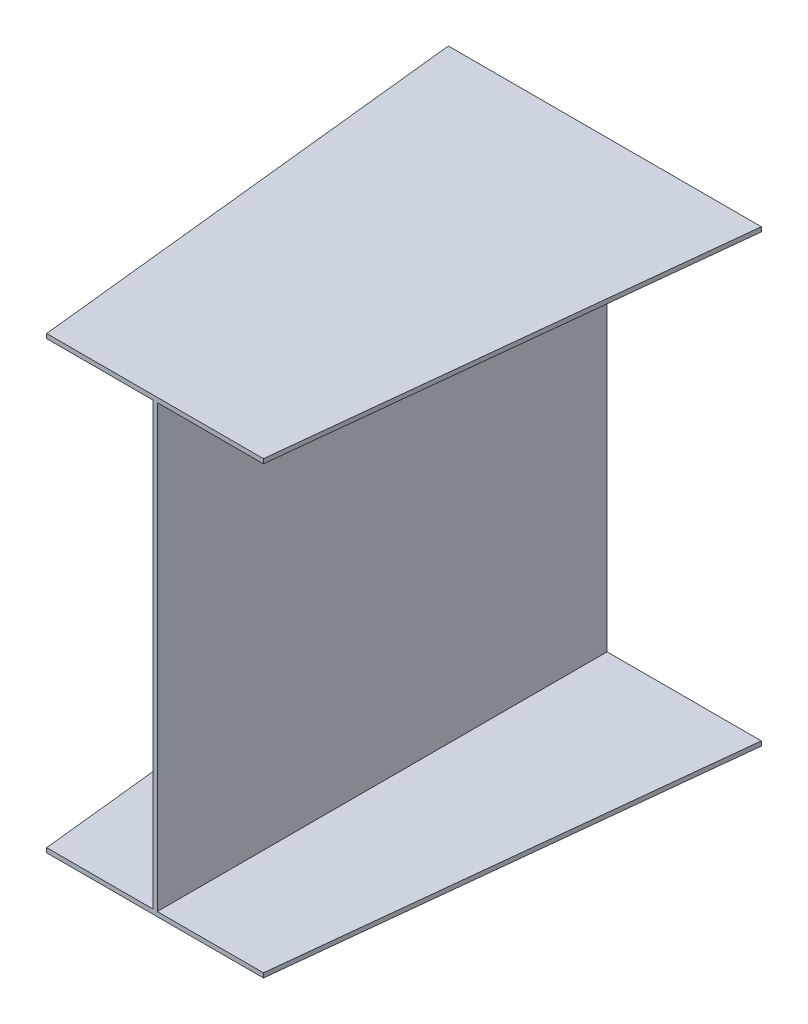
ISO-10303-21;
HEADER;
FILE_DESCRIPTION(('STEP AP214'),'2;1');
FILE_NAME('part.step','',(''),(''),'','','');
FILE_SCHEMA(('AUTOMOTIVE_DESIGN { 1 0 10303 214 1 1 1 1 }'));
ENDSEC;
DATA;
#1=APPLICATION_CONTEXT('core data for automotive mechanical design processes');
#2=APPLICATION_PROTOCOL_DEFINITION('international standard','automotive_design',2000,#1);
#3=PRODUCT_CONTEXT('',#1,'mechanical');
#4=PRODUCT('Part','Part','',(#3));
#5=PRODUCT_RELATED_PRODUCT_CATEGORY('part','',(#4));
#6=PRODUCT_DEFINITION_FORMATION('','',#4);
#7=PRODUCT_DEFINITION_CONTEXT('part definition',#1,'design');
#8=PRODUCT_DEFINITION('design','',#6,#7);
#9=PRODUCT_DEFINITION_SHAPE('','',#8);
#10=(LENGTH_UNIT() NAMED_UNIT(*) SI_UNIT(.MILLI.,.METRE.));
#11=(NAMED_UNIT(*) PLANE_ANGLE_UNIT() SI_UNIT($,.RADIAN.));
#12=(NAMED_UNIT(*) SI_UNIT($,.STERADIAN.) SOLID_ANGLE_UNIT());
#13=UNCERTAINTY_MEASURE_WITH_UNIT(LENGTH_MEASURE(1.E-05),#10,'distance_accuracy_value','');
#14=(GEOMETRIC_REPRESENTATION_CONTEXT(3) GLOBAL_UNCERTAINTY_ASSIGNED_CONTEXT((#13)) GLOBAL_UNIT_ASSIGNED_CONTEXT((#10,
#11,#12)) REPRESENTATION_CONTEXT('',''));
#15=CARTESIAN_POINT('',(0.,0.,0.));
#16=DIRECTION('',(0.,0.,1.));
#17=DIRECTION('',(1.,0.,0.));
#18=AXIS2_PLACEMENT_3D('',#15,#16,#17);
#19=CARTESIAN_POINT('',(0.,0.,1000.));
#20=DIRECTION('',(0.,0.,1.));
#21=DIRECTION('',(1.,0.,0.));
#22=AXIS2_PLACEMENT_3D('',#19,#20,#21);
#23=PLANE('',#22);
#24=DIRECTION('',(-1.,0.,0.));
#25=VECTOR('',#24,1.);
#26=CARTESIAN_POINT('',(-236.,0.,1000.));
#27=LINE('',#26,#25);
#28=CARTESIAN_POINT('',(0.,0.,1000.));
#29=VERTEX_POINT('',#28);
#30=CARTESIAN_POINT('',(-236.,0.,1000.));
#31=VERTEX_POINT('',#30);
#32=EDGE_CURVE('E360',#29,#31,#27,.T.);
#33=ORIENTED_EDGE('',*,*,#32,.T.);
#34=DIRECTION('',(0.,-1.,0.));
#35=VECTOR('',#34,1.);
#36=CARTESIAN_POINT('',(-236.,0.,1000.));
#37=LINE('',#36,#35);
#38=CARTESIAN_POINT('',(-236.,-10.,1000.));
#39=VERTEX_POINT('',#38);
#40=EDGE_CURVE('E12',#31,#39,#37,.T.);
#41=ORIENTED_EDGE('',*,*,#40,.T.);
#42=DIRECTION('',(1.,0.,0.));
#43=VECTOR('',#42,1.);
#44=CARTESIAN_POINT('',(-236.,-10.,1000.));
#45=LINE('',#44,#43);
#46=CARTESIAN_POINT('',(246.,-10.,1000.));
#47=VERTEX_POINT('',#46);
#48=EDGE_CURVE('E76',#39,#47,#45,.T.);
#49=ORIENTED_EDGE('',*,*,#48,.T.);
#50=DIRECTION('',(0.,1.,0.));
#51=VECTOR('',#50,1.);
#52=CARTESIAN_POINT('',(246.,0.,1000.));
#53=LINE('',#52,#51);
#54=CARTESIAN_POINT('',(246.,0.,1000.));
#55=VERTEX_POINT('',#54);
#56=EDGE_CURVE('E595',#47,#55,#53,.T.);
#57=ORIENTED_EDGE('',*,*,#56,.T.);
#58=DIRECTION('',(-1.,0.,0.));
#59=VECTOR('',#58,1.);
#60=CARTESIAN_POINT('',(10.,0.,1000.));
#61=LINE('',#60,#59);
#62=CARTESIAN_POINT('',(10.,0.,1000.));
#63=VERTEX_POINT('',#62);
#64=EDGE_CURVE('E572',#55,#63,#61,.T.);
#65=ORIENTED_EDGE('',*,*,#64,.T.);
#66=DIRECTION('',(0.,1.,0.));
#67=VECTOR('',#66,1.);
#68=CARTESIAN_POINT('',(10.,0.,1000.));
#69=LINE('',#68,#67);
#70=CARTESIAN_POINT('',(10.,980.,1000.));
#71=VERTEX_POINT('',#70);
#72=EDGE_CURVE('E568',#63,#71,#69,.T.);
#73=ORIENTED_EDGE('',*,*,#72,.T.);
#74=DIRECTION('',(1.,0.,0.));
#75=VECTOR('',#74,1.);
#76=CARTESIAN_POINT('',(10.,980.,1000.));
#77=LINE('',#76,#75);
#78=CARTESIAN_POINT('',(246.,980.,1000.));
#79=VERTEX_POINT('',#78);
#80=EDGE_CURVE('E558',#71,#79,#77,.T.);
#81=ORIENTED_EDGE('',*,*,#80,.T.);
#82=DIRECTION('',(0.,1.,0.));
#83=VECTOR('',#82,1.);
#84=CARTESIAN_POINT('',(246.,990.,1000.));
#85=LINE('',#84,#83);
#86=CARTESIAN_POINT('',(246.,990.,1000.));
#87=VERTEX_POINT('',#86);
#88=EDGE_CURVE('E480',#79,#87,#85,.T.);
#89=ORIENTED_EDGE('',*,*,#88,.T.);
#90=DIRECTION('',(-1.,0.,0.));
#91=VECTOR('',#90,1.);
#92=CARTESIAN_POINT('',(-236.,990.,1000.));
#93=LINE('',#92,#91);
#94=CARTESIAN_POINT('',(-236.,990.,1000.));
#95=VERTEX_POINT('',#94);
#96=EDGE_CURVE('E470',#87,#95,#93,.T.);
#97=ORIENTED_EDGE('',*,*,#96,.T.);
#98=DIRECTION('',(0.,-1.,0.));
#99=VECTOR('',#98,1.);
#100=CARTESIAN_POINT('',(-236.,990.,1000.));
#101=LINE('',#100,#99);
#102=CARTESIAN_POINT('',(-236.,980.,1000.));
#103=VERTEX_POINT('',#102);
#104=EDGE_CURVE('E481',#95,#103,#101,.T.);
#105=ORIENTED_EDGE('',*,*,#104,.T.);
#106=DIRECTION('',(1.,0.,0.));
#107=VECTOR('',#106,1.);
#108=CARTESIAN_POINT('',(-236.,980.,1000.));
#109=LINE('',#108,#107);
#110=CARTESIAN_POINT('',(0.,980.,1000.));
#111=VERTEX_POINT('',#110);
#112=EDGE_CURVE('E378',#103,#111,#109,.T.);
#113=ORIENTED_EDGE('',*,*,#112,.T.);
#114=DIRECTION('',(0.,-1.,0.));
#115=VECTOR('',#114,1.);
#116=CARTESIAN_POINT('',(0.,0.,1000.));
#117=LINE('',#116,#115);
#118=EDGE_CURVE('E306',#111,#29,#117,.T.);
#119=ORIENTED_EDGE('',*,*,#118,.T.);
#120=EDGE_LOOP('',(#33,#41,#49,#57,#65,#73,#81,#89,#97,#105,#113,#119));
#121=FACE_BOUND('',#120,.T.);
#122=ADVANCED_FACE('F65',(#121),#23,.T.);
#123=CARTESIAN_POINT('',(0.,0.,0.));
#124=DIRECTION('',(0.,0.,1.));
#125=DIRECTION('',(1.,0.,0.));
#126=AXIS2_PLACEMENT_3D('',#123,#124,#125);
#127=PLANE('',#126);
#128=DIRECTION('',(-1.,0.,0.));
#129=VECTOR('',#128,1.);
#130=CARTESIAN_POINT('',(-343.,0.,0.));
#131=LINE('',#130,#129);
#132=CARTESIAN_POINT('',(0.,0.,0.));
#133=VERTEX_POINT('',#132);
#134=CARTESIAN_POINT('',(-343.,0.,0.));
#135=VERTEX_POINT('',#134);
#136=EDGE_CURVE('E279',#133,#135,#131,.T.);
#137=ORIENTED_EDGE('',*,*,#136,.F.);
#138=DIRECTION('',(0.,-1.,0.));
#139=VECTOR('',#138,1.);
#140=CARTESIAN_POINT('',(0.,0.,0.));
#141=LINE('',#140,#139);
#142=CARTESIAN_POINT('',(0.,980.,0.));
#143=VERTEX_POINT('',#142);
#144=EDGE_CURVE('E270',#143,#133,#141,.T.);
#145=ORIENTED_EDGE('',*,*,#144,.F.);
#146=DIRECTION('',(1.,0.,0.));
#147=VECTOR('',#146,1.);
#148=CARTESIAN_POINT('',(-343.,980.,0.));
#149=LINE('',#148,#147);
#150=CARTESIAN_POINT('',(-343.,980.,0.));
#151=VERTEX_POINT('',#150);
#152=EDGE_CURVE('E278',#151,#143,#149,.T.);
#153=ORIENTED_EDGE('',*,*,#152,.F.);
#154=DIRECTION('',(0.,-1.,0.));
#155=VECTOR('',#154,1.);
#156=CARTESIAN_POINT('',(-343.,980.,0.));
#157=LINE('',#156,#155);
#158=CARTESIAN_POINT('',(-343.,990.,0.));
#159=VERTEX_POINT('',#158);
#160=EDGE_CURVE('E283',#159,#151,#157,.T.);
#161=ORIENTED_EDGE('',*,*,#160,.F.);
#162=DIRECTION('',(-1.,0.,0.));
#163=VECTOR('',#162,1.);
#164=CARTESIAN_POINT('',(-343.,990.,0.));
#165=LINE('',#164,#163);
#166=CARTESIAN_POINT('',(353.,990.,0.));
#167=VERTEX_POINT('',#166);
#168=EDGE_CURVE('E437',#167,#159,#165,.T.);
#169=ORIENTED_EDGE('',*,*,#168,.F.);
#170=DIRECTION('',(0.,1.,0.));
#171=VECTOR('',#170,1.);
#172=CARTESIAN_POINT('',(353.,980.,0.));
#173=LINE('',#172,#171);
#174=CARTESIAN_POINT('',(353.,980.,0.));
#175=VERTEX_POINT('',#174);
#176=EDGE_CURVE('E486',#175,#167,#173,.T.);
#177=ORIENTED_EDGE('',*,*,#176,.F.);
#178=DIRECTION('',(1.,0.,0.));
#179=VECTOR('',#178,1.);
#180=CARTESIAN_POINT('',(10.,980.,0.));
#181=LINE('',#180,#179);
#182=CARTESIAN_POINT('',(10.,980.,0.));
#183=VERTEX_POINT('',#182);
#184=EDGE_CURVE('E489',#183,#175,#181,.T.);
#185=ORIENTED_EDGE('',*,*,#184,.F.);
#186=DIRECTION('',(0.,1.,0.));
#187=VECTOR('',#186,1.);
#188=CARTESIAN_POINT('',(10.,0.,0.));
#189=LINE('',#188,#187);
#190=CARTESIAN_POINT('',(10.,0.,0.));
#191=VERTEX_POINT('',#190);
#192=EDGE_CURVE('E492',#191,#183,#189,.T.);
#193=ORIENTED_EDGE('',*,*,#192,.F.);
#194=DIRECTION('',(-1.,0.,0.));
#195=VECTOR('',#194,1.);
#196=CARTESIAN_POINT('',(10.,0.,0.));
#197=LINE('',#196,#195);
#198=CARTESIAN_POINT('',(353.,0.,0.));
#199=VERTEX_POINT('',#198);
#200=EDGE_CURVE('E677',#199,#191,#197,.T.);
#201=ORIENTED_EDGE('',*,*,#200,.F.);
#202=DIRECTION('',(0.,1.,0.));
#203=VECTOR('',#202,1.);
#204=CARTESIAN_POINT('',(353.,0.,0.));
#205=LINE('',#204,#203);
#206=CARTESIAN_POINT('',(353.,-10.,0.));
#207=VERTEX_POINT('',#206);
#208=EDGE_CURVE('E185',#207,#199,#205,.T.);
#209=ORIENTED_EDGE('',*,*,#208,.F.);
#210=DIRECTION('',(1.,0.,0.));
#211=VECTOR('',#210,1.);
#212=CARTESIAN_POINT('',(-343.,-10.,0.));
#213=LINE('',#212,#211);
#214=CARTESIAN_POINT('',(-343.,-10.,0.));
#215=VERTEX_POINT('',#214);
#216=EDGE_CURVE('E163',#215,#207,#213,.T.);
#217=ORIENTED_EDGE('',*,*,#216,.F.);
#218=DIRECTION('',(0.,-1.,0.));
#219=VECTOR('',#218,1.);
#220=CARTESIAN_POINT('',(-343.,0.,0.));
#221=LINE('',#220,#219);
#222=EDGE_CURVE('E171',#135,#215,#221,.T.);
#223=ORIENTED_EDGE('',*,*,#222,.F.);
#224=EDGE_LOOP('',(#137,#145,#153,#161,#169,#177,#185,#193,#201,#209,#217,#223));
#225=FACE_BOUND('',#224,.T.);
#226=ADVANCED_FACE('F183',(#225),#127,.F.);
#227=CARTESIAN_POINT('',(0.,0.,0.));
#228=DIRECTION('',(1.,0.,0.));
#229=DIRECTION('',(0.,0.,-1.));
#230=AXIS2_PLACEMENT_3D('',#227,#228,#229);
#231=PLANE('',#230);
#232=DIRECTION('',(0.,0.,1.));
#233=VECTOR('',#232,1.);
#234=CARTESIAN_POINT('',(0.,0.,0.));
#235=LINE('',#234,#233);
#236=EDGE_CURVE('E178',#133,#29,#235,.T.);
#237=ORIENTED_EDGE('',*,*,#236,.T.);
#238=ORIENTED_EDGE('',*,*,#118,.F.);
#239=DIRECTION('',(0.,0.,1.));
#240=VECTOR('',#239,1.);
#241=CARTESIAN_POINT('',(0.,980.,0.));
#242=LINE('',#241,#240);
#243=EDGE_CURVE('E296',#143,#111,#242,.T.);
#244=ORIENTED_EDGE('',*,*,#243,.F.);
#245=ORIENTED_EDGE('',*,*,#144,.T.);
#246=EDGE_LOOP('',(#237,#238,#244,#245));
#247=FACE_BOUND('',#246,.T.);
#248=ADVANCED_FACE('F205',(#247),#231,.F.);
#249=CARTESIAN_POINT('',(0.,980.,0.));
#250=DIRECTION('',(0.,1.,0.));
#251=DIRECTION('',(0.,0.,1.));
#252=AXIS2_PLACEMENT_3D('',#249,#250,#251);
#253=PLANE('',#252);
#254=ORIENTED_EDGE('',*,*,#243,.T.);
#255=ORIENTED_EDGE('',*,*,#112,.F.);
#256=DIRECTION('',(0.106392688385896,0.,0.994324190522398));
#257=VECTOR('',#256,1.);
#258=CARTESIAN_POINT('',(-343.,980.,0.));
#259=LINE('',#258,#257);
#260=EDGE_CURVE('E298',#151,#103,#259,.T.);
#261=ORIENTED_EDGE('',*,*,#260,.F.);
#262=ORIENTED_EDGE('',*,*,#152,.T.);
#263=EDGE_LOOP('',(#254,#255,#261,#262));
#264=FACE_BOUND('',#263,.T.);
#265=ADVANCED_FACE('F294',(#264),#253,.F.);
#266=CARTESIAN_POINT('',(0.,0.,0.));
#267=DIRECTION('',(0.,-1.,0.));
#268=DIRECTION('',(0.,0.,-1.));
#269=AXIS2_PLACEMENT_3D('',#266,#267,#268);
#270=PLANE('',#269);
#271=DIRECTION('',(0.106392688385896,0.,0.994324190522398));
#272=VECTOR('',#271,1.);
#273=CARTESIAN_POINT('',(-343.,0.,0.));
#274=LINE('',#273,#272);
#275=EDGE_CURVE('E84',#135,#31,#274,.T.);
#276=ORIENTED_EDGE('',*,*,#275,.T.);
#277=ORIENTED_EDGE('',*,*,#32,.F.);
#278=ORIENTED_EDGE('',*,*,#236,.F.);
#279=ORIENTED_EDGE('',*,*,#136,.T.);
#280=EDGE_LOOP('',(#276,#277,#278,#279));
#281=FACE_BOUND('',#280,.T.);
#282=ADVANCED_FACE('F335',(#281),#270,.F.);
#283=CARTESIAN_POINT('',(-339.117444379301,0.,36.2855665485852));
#284=DIRECTION('',(0.994324190522398,0.,-0.106392688385896));
#285=DIRECTION('',(-0.106392688385896,0.,-0.994324190522398));
#286=AXIS2_PLACEMENT_3D('',#283,#284,#285);
#287=PLANE('',#286);
#288=DIRECTION('',(0.106392688385896,0.,0.994324190522398));
#289=VECTOR('',#288,1.);
#290=CARTESIAN_POINT('',(-343.,-10.,0.));
#291=LINE('',#290,#289);
#292=EDGE_CURVE('E158',#215,#39,#291,.T.);
#293=ORIENTED_EDGE('',*,*,#292,.T.);
#294=ORIENTED_EDGE('',*,*,#40,.F.);
#295=ORIENTED_EDGE('',*,*,#275,.F.);
#296=ORIENTED_EDGE('',*,*,#222,.T.);
#297=EDGE_LOOP('',(#293,#294,#295,#296));
#298=FACE_BOUND('',#297,.T.);
#299=ADVANCED_FACE('F173',(#298),#287,.F.);
#300=CARTESIAN_POINT('',(0.,-10.,0.));
#301=DIRECTION('',(0.,1.,0.));
#302=DIRECTION('',(0.,0.,1.));
#303=AXIS2_PLACEMENT_3D('',#300,#301,#302);
#304=PLANE('',#303);
#305=DIRECTION('',(-0.106392688385897,0.,0.994324190522398));
#306=VECTOR('',#305,1.);
#307=CARTESIAN_POINT('',(353.,-10.,0.));
#308=LINE('',#307,#306);
#309=EDGE_CURVE('E169',#207,#47,#308,.T.);
#310=ORIENTED_EDGE('',*,*,#309,.T.);
#311=ORIENTED_EDGE('',*,*,#48,.F.);
#312=ORIENTED_EDGE('',*,*,#292,.F.);
#313=ORIENTED_EDGE('',*,*,#216,.T.);
#314=EDGE_LOOP('',(#310,#311,#312,#313));
#315=FACE_BOUND('',#314,.T.);
#316=ADVANCED_FACE('F161',(#315),#304,.F.);
#317=CARTESIAN_POINT('',(349.004250337882,0.,37.3434547861534));
#318=DIRECTION('',(-0.994324190522398,0.,-0.106392688385897));
#319=DIRECTION('',(-0.106392688385897,0.,0.994324190522398));
#320=AXIS2_PLACEMENT_3D('',#317,#318,#319);
#321=PLANE('',#320);
#322=DIRECTION('',(-0.106392688385897,0.,0.994324190522398));
#323=VECTOR('',#322,1.);
#324=CARTESIAN_POINT('',(353.,0.,0.));
#325=LINE('',#324,#323);
#326=EDGE_CURVE('E527',#199,#55,#325,.T.);
#327=ORIENTED_EDGE('',*,*,#326,.T.);
#328=ORIENTED_EDGE('',*,*,#56,.F.);
#329=ORIENTED_EDGE('',*,*,#309,.F.);
#330=ORIENTED_EDGE('',*,*,#208,.T.);
#331=EDGE_LOOP('',(#327,#328,#329,#330));
#332=FACE_BOUND('',#331,.T.);
#333=ADVANCED_FACE('F632',(#332),#321,.F.);
#334=CARTESIAN_POINT('',(0.,0.,0.));
#335=DIRECTION('',(0.,-1.,0.));
#336=DIRECTION('',(0.,0.,-1.));
#337=AXIS2_PLACEMENT_3D('',#334,#335,#336);
#338=PLANE('',#337);
#339=DIRECTION('',(0.,0.,1.));
#340=VECTOR('',#339,1.);
#341=CARTESIAN_POINT('',(10.,0.,0.));
#342=LINE('',#341,#340);
#343=EDGE_CURVE('E522',#191,#63,#342,.T.);
#344=ORIENTED_EDGE('',*,*,#343,.T.);
#345=ORIENTED_EDGE('',*,*,#64,.F.);
#346=ORIENTED_EDGE('',*,*,#326,.F.);
#347=ORIENTED_EDGE('',*,*,#200,.T.);
#348=EDGE_LOOP('',(#344,#345,#346,#347));
#349=FACE_BOUND('',#348,.T.);
#350=ADVANCED_FACE('F543',(#349),#338,.F.);
#351=CARTESIAN_POINT('',(10.,0.,0.));
#352=DIRECTION('',(-1.,0.,0.));
#353=DIRECTION('',(0.,0.,1.));
#354=AXIS2_PLACEMENT_3D('',#351,#352,#353);
#355=PLANE('',#354);
#356=DIRECTION('',(0.,0.,1.));
#357=VECTOR('',#356,1.);
#358=CARTESIAN_POINT('',(10.,980.,0.));
#359=LINE('',#358,#357);
#360=EDGE_CURVE('E506',#183,#71,#359,.T.);
#361=ORIENTED_EDGE('',*,*,#360,.T.);
#362=ORIENTED_EDGE('',*,*,#72,.F.);
#363=ORIENTED_EDGE('',*,*,#343,.F.);
#364=ORIENTED_EDGE('',*,*,#192,.T.);
#365=EDGE_LOOP('',(#361,#362,#363,#364));
#366=FACE_BOUND('',#365,.T.);
#367=ADVANCED_FACE('F534',(#366),#355,.F.);
#368=CARTESIAN_POINT('',(0.,980.,0.));
#369=DIRECTION('',(0.,1.,0.));
#370=DIRECTION('',(0.,0.,1.));
#371=AXIS2_PLACEMENT_3D('',#368,#369,#370);
#372=PLANE('',#371);
#373=DIRECTION('',(-0.106392688385897,0.,0.994324190522398));
#374=VECTOR('',#373,1.);
#375=CARTESIAN_POINT('',(353.,980.,0.));
#376=LINE('',#375,#374);
#377=EDGE_CURVE('E423',#175,#79,#376,.T.);
#378=ORIENTED_EDGE('',*,*,#377,.T.);
#379=ORIENTED_EDGE('',*,*,#80,.F.);
#380=ORIENTED_EDGE('',*,*,#360,.F.);
#381=ORIENTED_EDGE('',*,*,#184,.T.);
#382=EDGE_LOOP('',(#378,#379,#380,#381));
#383=FACE_BOUND('',#382,.T.);
#384=ADVANCED_FACE('F453',(#383),#372,.F.);
#385=CARTESIAN_POINT('',(349.004250337882,0.,37.3434547861534));
#386=DIRECTION('',(-0.994324190522398,0.,-0.106392688385897));
#387=DIRECTION('',(-0.106392688385897,0.,0.994324190522398));
#388=AXIS2_PLACEMENT_3D('',#385,#386,#387);
#389=PLANE('',#388);
#390=DIRECTION('',(-0.106392688385897,0.,0.994324190522398));
#391=VECTOR('',#390,1.);
#392=CARTESIAN_POINT('',(353.,990.,0.));
#393=LINE('',#392,#391);
#394=EDGE_CURVE('E416',#167,#87,#393,.T.);
#395=ORIENTED_EDGE('',*,*,#394,.T.);
#396=ORIENTED_EDGE('',*,*,#88,.F.);
#397=ORIENTED_EDGE('',*,*,#377,.F.);
#398=ORIENTED_EDGE('',*,*,#176,.T.);
#399=EDGE_LOOP('',(#395,#396,#397,#398));
#400=FACE_BOUND('',#399,.T.);
#401=ADVANCED_FACE('F444',(#400),#389,.F.);
#402=CARTESIAN_POINT('',(0.,990.,0.));
#403=DIRECTION('',(0.,-1.,0.));
#404=DIRECTION('',(0.,0.,-1.));
#405=AXIS2_PLACEMENT_3D('',#402,#403,#404);
#406=PLANE('',#405);
#407=DIRECTION('',(0.106392688385896,0.,0.994324190522398));
#408=VECTOR('',#407,1.);
#409=CARTESIAN_POINT('',(-343.,990.,0.));
#410=LINE('',#409,#408);
#411=EDGE_CURVE('E410',#159,#95,#410,.T.);
#412=ORIENTED_EDGE('',*,*,#411,.T.);
#413=ORIENTED_EDGE('',*,*,#96,.F.);
#414=ORIENTED_EDGE('',*,*,#394,.F.);
#415=ORIENTED_EDGE('',*,*,#168,.T.);
#416=EDGE_LOOP('',(#412,#413,#414,#415));
#417=FACE_BOUND('',#416,.T.);
#418=ADVANCED_FACE('F393',(#417),#406,.F.);
#419=CARTESIAN_POINT('',(-339.117444379301,0.,36.2855665485852));
#420=DIRECTION('',(0.994324190522398,0.,-0.106392688385896));
#421=DIRECTION('',(-0.106392688385896,0.,-0.994324190522398));
#422=AXIS2_PLACEMENT_3D('',#419,#420,#421);
#423=PLANE('',#422);
#424=ORIENTED_EDGE('',*,*,#260,.T.);
#425=ORIENTED_EDGE('',*,*,#104,.F.);
#426=ORIENTED_EDGE('',*,*,#411,.F.);
#427=ORIENTED_EDGE('',*,*,#160,.T.);
#428=EDGE_LOOP('',(#424,#425,#426,#427));
#429=FACE_BOUND('',#428,.T.);
#430=ADVANCED_FACE('F384',(#429),#423,.F.);
#431=CLOSED_SHELL('',(#122,#226,#248,#265,#282,#299,#316,#333,#350,#367,#384,#401,#418,#430));
#432=MANIFOLD_SOLID_BREP('B2',#431);
#433=ADVANCED_BREP_SHAPE_REPRESENTATION('',(#18,#432),#14);
#434=SHAPE_DEFINITION_REPRESENTATION(#9,#433);
ENDSEC;
END-ISO-10303-21;
